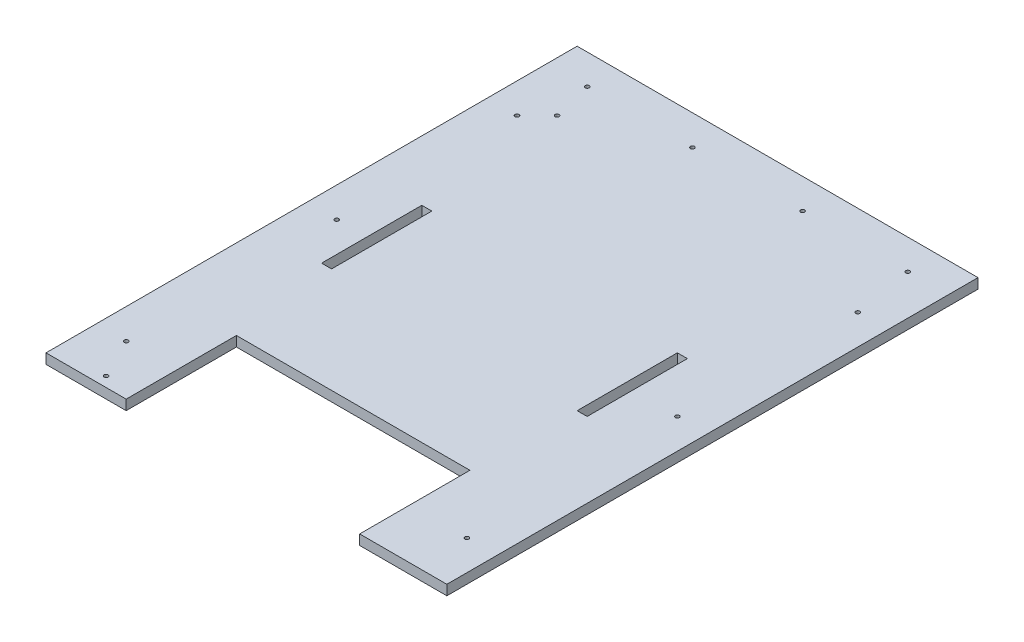
ISO-10303-21;
HEADER;
FILE_DESCRIPTION(('STEP AP214'),'2;1');
FILE_NAME('part.step','',(''),(''),'','','');
FILE_SCHEMA(('AUTOMOTIVE_DESIGN { 1 0 10303 214 1 1 1 1 }'));
ENDSEC;
DATA;
#1=APPLICATION_CONTEXT('core data for automotive mechanical design processes');
#2=APPLICATION_PROTOCOL_DEFINITION('international standard','automotive_design',2000,#1);
#3=PRODUCT_CONTEXT('',#1,'mechanical');
#4=PRODUCT('Part','Part','',(#3));
#5=PRODUCT_RELATED_PRODUCT_CATEGORY('part','',(#4));
#6=PRODUCT_DEFINITION_FORMATION('','',#4);
#7=PRODUCT_DEFINITION_CONTEXT('part definition',#1,'design');
#8=PRODUCT_DEFINITION('design','',#6,#7);
#9=PRODUCT_DEFINITION_SHAPE('','',#8);
#10=(LENGTH_UNIT() NAMED_UNIT(*) SI_UNIT(.MILLI.,.METRE.));
#11=(NAMED_UNIT(*) PLANE_ANGLE_UNIT() SI_UNIT($,.RADIAN.));
#12=(NAMED_UNIT(*) SI_UNIT($,.STERADIAN.) SOLID_ANGLE_UNIT());
#13=UNCERTAINTY_MEASURE_WITH_UNIT(LENGTH_MEASURE(1.E-05),#10,'distance_accuracy_value','');
#14=(GEOMETRIC_REPRESENTATION_CONTEXT(3) GLOBAL_UNCERTAINTY_ASSIGNED_CONTEXT((#13)) GLOBAL_UNIT_ASSIGNED_CONTEXT((#10,
#11,#12)) REPRESENTATION_CONTEXT('',''));
#15=CARTESIAN_POINT('',(0.,0.,0.));
#16=DIRECTION('',(0.,0.,1.));
#17=DIRECTION('',(1.,0.,0.));
#18=AXIS2_PLACEMENT_3D('',#15,#16,#17);
#19=CARTESIAN_POINT('',(0.,10.,0.));
#20=DIRECTION('',(0.,-1.,0.));
#21=DIRECTION('',(0.,0.,-1.));
#22=AXIS2_PLACEMENT_3D('',#19,#20,#21);
#23=PLANE('',#22);
#24=DIRECTION('',(0.,0.,1.));
#25=VECTOR('',#24,1.);
#26=CARTESIAN_POINT('',(-140.,10.,-215.));
#27=LINE('',#26,#25);
#28=CARTESIAN_POINT('',(-140.,10.,-315.));
#29=VERTEX_POINT('',#28);
#30=CARTESIAN_POINT('',(-140.,10.,-215.));
#31=VERTEX_POINT('',#30);
#32=EDGE_CURVE('E186',#29,#31,#27,.T.);
#33=ORIENTED_EDGE('',*,*,#32,.F.);
#34=DIRECTION('',(-1.,0.,0.));
#35=VECTOR('',#34,1.);
#36=CARTESIAN_POINT('',(-140.,10.,-315.));
#37=LINE('',#36,#35);
#38=CARTESIAN_POINT('',(-130.,10.,-315.));
#39=VERTEX_POINT('',#38);
#40=EDGE_CURVE('E194',#39,#29,#37,.T.);
#41=ORIENTED_EDGE('',*,*,#40,.F.);
#42=DIRECTION('',(0.,0.,-1.));
#43=VECTOR('',#42,1.);
#44=CARTESIAN_POINT('',(-130.,10.,-315.));
#45=LINE('',#44,#43);
#46=CARTESIAN_POINT('',(-130.,10.,-215.));
#47=VERTEX_POINT('',#46);
#48=EDGE_CURVE('E191',#47,#39,#45,.T.);
#49=ORIENTED_EDGE('',*,*,#48,.F.);
#50=DIRECTION('',(1.,0.,0.));
#51=VECTOR('',#50,1.);
#52=CARTESIAN_POINT('',(-130.,10.,-215.));
#53=LINE('',#52,#51);
#54=EDGE_CURVE('E188',#31,#47,#53,.T.);
#55=ORIENTED_EDGE('',*,*,#54,.F.);
#56=EDGE_LOOP('',(#33,#41,#49,#55));
#57=FACE_BOUND('',#56,.T.);
#58=DIRECTION('',(-1.,0.,0.));
#59=VECTOR('',#58,1.);
#60=CARTESIAN_POINT('',(-200.,10.,-530.));
#61=LINE('',#60,#59);
#62=CARTESIAN_POINT('',(200.,10.,-530.));
#63=VERTEX_POINT('',#62);
#64=CARTESIAN_POINT('',(-200.,10.,-530.));
#65=VERTEX_POINT('',#64);
#66=EDGE_CURVE('E229',#63,#65,#61,.T.);
#67=ORIENTED_EDGE('',*,*,#66,.T.);
#68=DIRECTION('',(0.,0.,1.));
#69=VECTOR('',#68,1.);
#70=CARTESIAN_POINT('',(-200.,10.,-530.));
#71=LINE('',#70,#69);
#72=CARTESIAN_POINT('',(-200.,10.,0.));
#73=VERTEX_POINT('',#72);
#74=EDGE_CURVE('E232',#65,#73,#71,.T.);
#75=ORIENTED_EDGE('',*,*,#74,.T.);
#76=DIRECTION('',(1.,0.,0.));
#77=VECTOR('',#76,1.);
#78=CARTESIAN_POINT('',(-200.,10.,0.));
#79=LINE('',#78,#77);
#80=CARTESIAN_POINT('',(-120.,10.,0.));
#81=VERTEX_POINT('',#80);
#82=EDGE_CURVE('E235',#73,#81,#79,.T.);
#83=ORIENTED_EDGE('',*,*,#82,.T.);
#84=DIRECTION('',(0.,0.,-1.));
#85=VECTOR('',#84,1.);
#86=CARTESIAN_POINT('',(-120.,10.,0.));
#87=LINE('',#86,#85);
#88=CARTESIAN_POINT('',(-120.,10.,-110.));
#89=VERTEX_POINT('',#88);
#90=EDGE_CURVE('E237',#81,#89,#87,.T.);
#91=ORIENTED_EDGE('',*,*,#90,.T.);
#92=DIRECTION('',(1.,0.,0.));
#93=VECTOR('',#92,1.);
#94=CARTESIAN_POINT('',(-120.,10.,-110.));
#95=LINE('',#94,#93);
#96=CARTESIAN_POINT('',(113.,10.,-110.));
#97=VERTEX_POINT('',#96);
#98=EDGE_CURVE('E239',#89,#97,#95,.T.);
#99=ORIENTED_EDGE('',*,*,#98,.T.);
#100=DIRECTION('',(0.,0.,1.));
#101=VECTOR('',#100,1.);
#102=CARTESIAN_POINT('',(113.,10.,-110.));
#103=LINE('',#102,#101);
#104=CARTESIAN_POINT('',(113.,10.,0.));
#105=VERTEX_POINT('',#104);
#106=EDGE_CURVE('E241',#97,#105,#103,.T.);
#107=ORIENTED_EDGE('',*,*,#106,.T.);
#108=DIRECTION('',(1.,0.,0.));
#109=VECTOR('',#108,1.);
#110=CARTESIAN_POINT('',(113.,10.,0.));
#111=LINE('',#110,#109);
#112=CARTESIAN_POINT('',(200.,10.,0.));
#113=VERTEX_POINT('',#112);
#114=EDGE_CURVE('E243',#105,#113,#111,.T.);
#115=ORIENTED_EDGE('',*,*,#114,.T.);
#116=DIRECTION('',(0.,0.,-1.));
#117=VECTOR('',#116,1.);
#118=CARTESIAN_POINT('',(200.,10.,-530.));
#119=LINE('',#118,#117);
#120=EDGE_CURVE('E245',#113,#63,#119,.T.);
#121=ORIENTED_EDGE('',*,*,#120,.T.);
#122=EDGE_LOOP('',(#67,#75,#83,#91,#99,#107,#115,#121));
#123=FACE_BOUND('',#122,.T.);
#124=CARTESIAN_POINT('',(-55.,10.,-500.));
#125=DIRECTION('',(0.,1.,0.));
#126=DIRECTION('',(0.,0.,1.));
#127=AXIS2_PLACEMENT_3D('',#124,#125,#126);
#128=CIRCLE('',#127,2.);
#129=CARTESIAN_POINT('',(-55.,10.,-498.));
#130=VERTEX_POINT('',#129);
#131=EDGE_CURVE('E223',#130,#130,#128,.T.);
#132=ORIENTED_EDGE('',*,*,#131,.F.);
#133=EDGE_LOOP('',(#132));
#134=FACE_BOUND('',#133,.T.);
#135=CARTESIAN_POINT('',(55.,10.,-500.));
#136=DIRECTION('',(0.,1.,0.));
#137=DIRECTION('',(0.,0.,1.));
#138=AXIS2_PLACEMENT_3D('',#135,#136,#137);
#139=CIRCLE('',#138,2.);
#140=CARTESIAN_POINT('',(55.,10.,-498.));
#141=VERTEX_POINT('',#140);
#142=EDGE_CURVE('E217',#141,#141,#139,.T.);
#143=ORIENTED_EDGE('',*,*,#142,.F.);
#144=EDGE_LOOP('',(#143));
#145=FACE_BOUND('',#144,.T.);
#146=DIRECTION('',(0.,0.,-1.));
#147=VECTOR('',#146,1.);
#148=CARTESIAN_POINT('',(125.,10.,-215.));
#149=LINE('',#148,#147);
#150=CARTESIAN_POINT('',(125.,10.,-215.));
#151=VERTEX_POINT('',#150);
#152=CARTESIAN_POINT('',(125.,10.,-315.));
#153=VERTEX_POINT('',#152);
#154=EDGE_CURVE('E147',#151,#153,#149,.T.);
#155=ORIENTED_EDGE('',*,*,#154,.F.);
#156=DIRECTION('',(1.,0.,0.));
#157=VECTOR('',#156,1.);
#158=CARTESIAN_POINT('',(115.,10.,-215.));
#159=LINE('',#158,#157);
#160=CARTESIAN_POINT('',(115.,10.,-215.));
#161=VERTEX_POINT('',#160);
#162=EDGE_CURVE('E170',#161,#151,#159,.T.);
#163=ORIENTED_EDGE('',*,*,#162,.F.);
#164=DIRECTION('',(0.,0.,1.));
#165=VECTOR('',#164,1.);
#166=CARTESIAN_POINT('',(115.,10.,-315.));
#167=LINE('',#166,#165);
#168=CARTESIAN_POINT('',(115.,10.,-315.));
#169=VERTEX_POINT('',#168);
#170=EDGE_CURVE('E168',#169,#161,#167,.T.);
#171=ORIENTED_EDGE('',*,*,#170,.F.);
#172=DIRECTION('',(-1.,0.,0.));
#173=VECTOR('',#172,1.);
#174=CARTESIAN_POINT('',(125.,10.,-315.));
#175=LINE('',#174,#173);
#176=EDGE_CURVE('E155',#153,#169,#175,.T.);
#177=ORIENTED_EDGE('',*,*,#176,.F.);
#178=EDGE_LOOP('',(#155,#163,#171,#177));
#179=FACE_BOUND('',#178,.T.);
#180=CARTESIAN_POINT('',(160.,10.,-500.));
#181=DIRECTION('',(0.,1.,0.));
#182=DIRECTION('',(0.,0.,1.));
#183=AXIS2_PLACEMENT_3D('',#180,#181,#182);
#184=CIRCLE('',#183,2.);
#185=CARTESIAN_POINT('',(160.,10.,-498.));
#186=VERTEX_POINT('',#185);
#187=EDGE_CURVE('E176',#186,#186,#184,.T.);
#188=ORIENTED_EDGE('',*,*,#187,.F.);
#189=EDGE_LOOP('',(#188));
#190=FACE_BOUND('',#189,.T.);
#191=CARTESIAN_POINT('',(-170.,10.,-260.));
#192=DIRECTION('',(0.,1.,0.));
#193=DIRECTION('',(0.,0.,1.));
#194=AXIS2_PLACEMENT_3D('',#191,#192,#193);
#195=CIRCLE('',#194,2.);
#196=CARTESIAN_POINT('',(-170.,10.,-258.));
#197=VERTEX_POINT('',#196);
#198=EDGE_CURVE('E427',#197,#197,#195,.T.);
#199=ORIENTED_EDGE('',*,*,#198,.F.);
#200=EDGE_LOOP('',(#199));
#201=FACE_BOUND('',#200,.T.);
#202=CARTESIAN_POINT('',(-170.,10.,-440.));
#203=DIRECTION('',(0.,1.,0.));
#204=DIRECTION('',(0.,0.,1.));
#205=AXIS2_PLACEMENT_3D('',#202,#203,#204);
#206=CIRCLE('',#205,2.);
#207=CARTESIAN_POINT('',(-170.,10.,-438.));
#208=VERTEX_POINT('',#207);
#209=EDGE_CURVE('E422',#208,#208,#206,.T.);
#210=ORIENTED_EDGE('',*,*,#209,.F.);
#211=EDGE_LOOP('',(#210));
#212=FACE_BOUND('',#211,.T.);
#213=CARTESIAN_POINT('',(-160.,10.,-500.));
#214=DIRECTION('',(0.,1.,0.));
#215=DIRECTION('',(0.,0.,1.));
#216=AXIS2_PLACEMENT_3D('',#213,#214,#215);
#217=CIRCLE('',#216,2.);
#218=CARTESIAN_POINT('',(-160.,10.,-498.));
#219=VERTEX_POINT('',#218);
#220=EDGE_CURVE('E417',#219,#219,#217,.T.);
#221=ORIENTED_EDGE('',*,*,#220,.F.);
#222=EDGE_LOOP('',(#221));
#223=FACE_BOUND('',#222,.T.);
#224=CARTESIAN_POINT('',(170.,10.,-260.));
#225=DIRECTION('',(0.,1.,0.));
#226=DIRECTION('',(0.,0.,1.));
#227=AXIS2_PLACEMENT_3D('',#224,#225,#226);
#228=CIRCLE('',#227,2.);
#229=CARTESIAN_POINT('',(170.,10.,-258.));
#230=VERTEX_POINT('',#229);
#231=EDGE_CURVE('E412',#230,#230,#228,.T.);
#232=ORIENTED_EDGE('',*,*,#231,.F.);
#233=EDGE_LOOP('',(#232));
#234=FACE_BOUND('',#233,.T.);
#235=CARTESIAN_POINT('',(170.,10.,-50.));
#236=DIRECTION('',(0.,1.,0.));
#237=DIRECTION('',(0.,0.,1.));
#238=AXIS2_PLACEMENT_3D('',#235,#236,#237);
#239=CIRCLE('',#238,2.);
#240=CARTESIAN_POINT('',(170.,10.,-48.));
#241=VERTEX_POINT('',#240);
#242=EDGE_CURVE('E407',#241,#241,#239,.T.);
#243=ORIENTED_EDGE('',*,*,#242,.F.);
#244=EDGE_LOOP('',(#243));
#245=FACE_BOUND('',#244,.T.);
#246=CARTESIAN_POINT('',(170.,10.,-440.));
#247=DIRECTION('',(0.,1.,0.));
#248=DIRECTION('',(0.,0.,1.));
#249=AXIS2_PLACEMENT_3D('',#246,#247,#248);
#250=CIRCLE('',#249,2.);
#251=CARTESIAN_POINT('',(170.,10.,-438.));
#252=VERTEX_POINT('',#251);
#253=EDGE_CURVE('E402',#252,#252,#250,.T.);
#254=ORIENTED_EDGE('',*,*,#253,.F.);
#255=EDGE_LOOP('',(#254));
#256=FACE_BOUND('',#255,.T.);
#257=CARTESIAN_POINT('',(-150.,10.,-460.));
#258=DIRECTION('',(0.,1.,0.));
#259=DIRECTION('',(0.,0.,1.));
#260=AXIS2_PLACEMENT_3D('',#257,#258,#259);
#261=CIRCLE('',#260,2.);
#262=CARTESIAN_POINT('',(-150.,10.,-458.));
#263=VERTEX_POINT('',#262);
#264=EDGE_CURVE('E397',#263,#263,#261,.T.);
#265=ORIENTED_EDGE('',*,*,#264,.F.);
#266=EDGE_LOOP('',(#265));
#267=FACE_BOUND('',#266,.T.);
#268=CARTESIAN_POINT('',(-170.,10.,-50.));
#269=DIRECTION('',(0.,1.,0.));
#270=DIRECTION('',(0.,0.,1.));
#271=AXIS2_PLACEMENT_3D('',#268,#269,#270);
#272=CIRCLE('',#271,2.);
#273=CARTESIAN_POINT('',(-170.,10.,-48.));
#274=VERTEX_POINT('',#273);
#275=EDGE_CURVE('E392',#274,#274,#272,.T.);
#276=ORIENTED_EDGE('',*,*,#275,.F.);
#277=EDGE_LOOP('',(#276));
#278=FACE_BOUND('',#277,.T.);
#279=CARTESIAN_POINT('',(-150.,10.,-10.));
#280=DIRECTION('',(0.,1.,0.));
#281=DIRECTION('',(0.,0.,1.));
#282=AXIS2_PLACEMENT_3D('',#279,#280,#281);
#283=CIRCLE('',#282,2.);
#284=CARTESIAN_POINT('',(-150.,10.,-8.));
#285=VERTEX_POINT('',#284);
#286=EDGE_CURVE('E386',#285,#285,#283,.T.);
#287=ORIENTED_EDGE('',*,*,#286,.F.);
#288=EDGE_LOOP('',(#287));
#289=FACE_BOUND('',#288,.T.);
#290=ADVANCED_FACE('F34',(#57,#123,#134,#145,#179,#190,#201,#212,#223,#234,#245,#256,#267,#278,
#289),#23,.F.);
#291=CARTESIAN_POINT('',(0.,0.,0.));
#292=DIRECTION('',(0.,-1.,0.));
#293=DIRECTION('',(0.,0.,-1.));
#294=AXIS2_PLACEMENT_3D('',#291,#292,#293);
#295=PLANE('',#294);
#296=CARTESIAN_POINT('',(-170.,0.,-50.));
#297=DIRECTION('',(0.,1.,0.));
#298=DIRECTION('',(0.,0.,1.));
#299=AXIS2_PLACEMENT_3D('',#296,#297,#298);
#300=CIRCLE('',#299,2.);
#301=CARTESIAN_POINT('',(-170.,0.,-48.));
#302=VERTEX_POINT('',#301);
#303=EDGE_CURVE('E389',#302,#302,#300,.T.);
#304=ORIENTED_EDGE('',*,*,#303,.T.);
#305=EDGE_LOOP('',(#304));
#306=FACE_BOUND('',#305,.T.);
#307=CARTESIAN_POINT('',(170.,0.,-440.));
#308=DIRECTION('',(0.,1.,0.));
#309=DIRECTION('',(0.,0.,1.));
#310=AXIS2_PLACEMENT_3D('',#307,#308,#309);
#311=CIRCLE('',#310,2.);
#312=CARTESIAN_POINT('',(170.,0.,-438.));
#313=VERTEX_POINT('',#312);
#314=EDGE_CURVE('E400',#313,#313,#311,.T.);
#315=ORIENTED_EDGE('',*,*,#314,.T.);
#316=EDGE_LOOP('',(#315));
#317=FACE_BOUND('',#316,.T.);
#318=CARTESIAN_POINT('',(170.,0.,-260.));
#319=DIRECTION('',(0.,1.,0.));
#320=DIRECTION('',(0.,0.,1.));
#321=AXIS2_PLACEMENT_3D('',#318,#319,#320);
#322=CIRCLE('',#321,2.);
#323=CARTESIAN_POINT('',(170.,0.,-258.));
#324=VERTEX_POINT('',#323);
#325=EDGE_CURVE('E410',#324,#324,#322,.T.);
#326=ORIENTED_EDGE('',*,*,#325,.T.);
#327=EDGE_LOOP('',(#326));
#328=FACE_BOUND('',#327,.T.);
#329=CARTESIAN_POINT('',(-170.,0.,-440.));
#330=DIRECTION('',(0.,1.,0.));
#331=DIRECTION('',(0.,0.,1.));
#332=AXIS2_PLACEMENT_3D('',#329,#330,#331);
#333=CIRCLE('',#332,2.);
#334=CARTESIAN_POINT('',(-170.,0.,-438.));
#335=VERTEX_POINT('',#334);
#336=EDGE_CURVE('E420',#335,#335,#333,.T.);
#337=ORIENTED_EDGE('',*,*,#336,.T.);
#338=EDGE_LOOP('',(#337));
#339=FACE_BOUND('',#338,.T.);
#340=CARTESIAN_POINT('',(160.,0.,-500.));
#341=DIRECTION('',(0.,1.,0.));
#342=DIRECTION('',(0.,0.,1.));
#343=AXIS2_PLACEMENT_3D('',#340,#341,#342);
#344=CIRCLE('',#343,2.);
#345=CARTESIAN_POINT('',(160.,0.,-498.));
#346=VERTEX_POINT('',#345);
#347=EDGE_CURVE('E430',#346,#346,#344,.T.);
#348=ORIENTED_EDGE('',*,*,#347,.T.);
#349=EDGE_LOOP('',(#348));
#350=FACE_BOUND('',#349,.T.);
#351=CARTESIAN_POINT('',(-55.,0.,-500.));
#352=DIRECTION('',(0.,1.,0.));
#353=DIRECTION('',(0.,0.,1.));
#354=AXIS2_PLACEMENT_3D('',#351,#352,#353);
#355=CIRCLE('',#354,2.);
#356=CARTESIAN_POINT('',(-55.,0.,-498.));
#357=VERTEX_POINT('',#356);
#358=EDGE_CURVE('E220',#357,#357,#355,.T.);
#359=ORIENTED_EDGE('',*,*,#358,.T.);
#360=EDGE_LOOP('',(#359));
#361=FACE_BOUND('',#360,.T.);
#362=DIRECTION('',(-1.,0.,0.));
#363=VECTOR('',#362,1.);
#364=CARTESIAN_POINT('',(-200.,0.,-530.));
#365=LINE('',#364,#363);
#366=CARTESIAN_POINT('',(200.,0.,-530.));
#367=VERTEX_POINT('',#366);
#368=CARTESIAN_POINT('',(-200.,0.,-530.));
#369=VERTEX_POINT('',#368);
#370=EDGE_CURVE('E226',#367,#369,#365,.T.);
#371=ORIENTED_EDGE('',*,*,#370,.F.);
#372=DIRECTION('',(0.,0.,-1.));
#373=VECTOR('',#372,1.);
#374=CARTESIAN_POINT('',(200.,0.,-530.));
#375=LINE('',#374,#373);
#376=CARTESIAN_POINT('',(200.,0.,0.));
#377=VERTEX_POINT('',#376);
#378=EDGE_CURVE('E233',#377,#367,#375,.T.);
#379=ORIENTED_EDGE('',*,*,#378,.F.);
#380=DIRECTION('',(1.,0.,0.));
#381=VECTOR('',#380,1.);
#382=CARTESIAN_POINT('',(113.,0.,0.));
#383=LINE('',#382,#381);
#384=CARTESIAN_POINT('',(113.,0.,0.));
#385=VERTEX_POINT('',#384);
#386=EDGE_CURVE('E260',#385,#377,#383,.T.);
#387=ORIENTED_EDGE('',*,*,#386,.F.);
#388=DIRECTION('',(0.,0.,1.));
#389=VECTOR('',#388,1.);
#390=CARTESIAN_POINT('',(113.,0.,-110.));
#391=LINE('',#390,#389);
#392=CARTESIAN_POINT('',(113.,0.,-110.));
#393=VERTEX_POINT('',#392);
#394=EDGE_CURVE('E258',#393,#385,#391,.T.);
#395=ORIENTED_EDGE('',*,*,#394,.F.);
#396=DIRECTION('',(1.,0.,0.));
#397=VECTOR('',#396,1.);
#398=CARTESIAN_POINT('',(-120.,0.,-110.));
#399=LINE('',#398,#397);
#400=CARTESIAN_POINT('',(-120.,0.,-110.));
#401=VERTEX_POINT('',#400);
#402=EDGE_CURVE('E256',#401,#393,#399,.T.);
#403=ORIENTED_EDGE('',*,*,#402,.F.);
#404=DIRECTION('',(0.,0.,-1.));
#405=VECTOR('',#404,1.);
#406=CARTESIAN_POINT('',(-120.,0.,0.));
#407=LINE('',#406,#405);
#408=CARTESIAN_POINT('',(-120.,0.,0.));
#409=VERTEX_POINT('',#408);
#410=EDGE_CURVE('E254',#409,#401,#407,.T.);
#411=ORIENTED_EDGE('',*,*,#410,.F.);
#412=DIRECTION('',(1.,0.,0.));
#413=VECTOR('',#412,1.);
#414=CARTESIAN_POINT('',(-200.,0.,0.));
#415=LINE('',#414,#413);
#416=CARTESIAN_POINT('',(-200.,0.,0.));
#417=VERTEX_POINT('',#416);
#418=EDGE_CURVE('E252',#417,#409,#415,.T.);
#419=ORIENTED_EDGE('',*,*,#418,.F.);
#420=DIRECTION('',(0.,0.,1.));
#421=VECTOR('',#420,1.);
#422=CARTESIAN_POINT('',(-200.,0.,-530.));
#423=LINE('',#422,#421);
#424=EDGE_CURVE('E250',#369,#417,#423,.T.);
#425=ORIENTED_EDGE('',*,*,#424,.F.);
#426=EDGE_LOOP('',(#371,#379,#387,#395,#403,#411,#419,#425));
#427=FACE_BOUND('',#426,.T.);
#428=CARTESIAN_POINT('',(55.,0.,-500.));
#429=DIRECTION('',(0.,1.,0.));
#430=DIRECTION('',(0.,0.,1.));
#431=AXIS2_PLACEMENT_3D('',#428,#429,#430);
#432=CIRCLE('',#431,2.);
#433=CARTESIAN_POINT('',(55.,0.,-498.));
#434=VERTEX_POINT('',#433);
#435=EDGE_CURVE('E216',#434,#434,#432,.T.);
#436=ORIENTED_EDGE('',*,*,#435,.T.);
#437=EDGE_LOOP('',(#436));
#438=FACE_BOUND('',#437,.T.);
#439=DIRECTION('',(-1.,0.,0.));
#440=VECTOR('',#439,1.);
#441=CARTESIAN_POINT('',(-140.,0.,-315.));
#442=LINE('',#441,#440);
#443=CARTESIAN_POINT('',(-130.,0.,-315.));
#444=VERTEX_POINT('',#443);
#445=CARTESIAN_POINT('',(-140.,0.,-315.));
#446=VERTEX_POINT('',#445);
#447=EDGE_CURVE('E189',#444,#446,#442,.T.);
#448=ORIENTED_EDGE('',*,*,#447,.T.);
#449=DIRECTION('',(0.,0.,1.));
#450=VECTOR('',#449,1.);
#451=CARTESIAN_POINT('',(-140.,0.,-215.));
#452=LINE('',#451,#450);
#453=CARTESIAN_POINT('',(-140.,0.,-215.));
#454=VERTEX_POINT('',#453);
#455=EDGE_CURVE('E163',#446,#454,#452,.T.);
#456=ORIENTED_EDGE('',*,*,#455,.T.);
#457=DIRECTION('',(1.,0.,0.));
#458=VECTOR('',#457,1.);
#459=CARTESIAN_POINT('',(-130.,0.,-215.));
#460=LINE('',#459,#458);
#461=CARTESIAN_POINT('',(-130.,0.,-215.));
#462=VERTEX_POINT('',#461);
#463=EDGE_CURVE('E199',#454,#462,#460,.T.);
#464=ORIENTED_EDGE('',*,*,#463,.T.);
#465=DIRECTION('',(0.,0.,-1.));
#466=VECTOR('',#465,1.);
#467=CARTESIAN_POINT('',(-130.,0.,-315.));
#468=LINE('',#467,#466);
#469=EDGE_CURVE('E202',#462,#444,#468,.T.);
#470=ORIENTED_EDGE('',*,*,#469,.T.);
#471=EDGE_LOOP('',(#448,#456,#464,#470));
#472=FACE_BOUND('',#471,.T.);
#473=DIRECTION('',(1.,0.,0.));
#474=VECTOR('',#473,1.);
#475=CARTESIAN_POINT('',(115.,0.,-215.));
#476=LINE('',#475,#474);
#477=CARTESIAN_POINT('',(115.,0.,-215.));
#478=VERTEX_POINT('',#477);
#479=CARTESIAN_POINT('',(125.,0.,-215.));
#480=VERTEX_POINT('',#479);
#481=EDGE_CURVE('E156',#478,#480,#476,.T.);
#482=ORIENTED_EDGE('',*,*,#481,.T.);
#483=DIRECTION('',(0.,0.,-1.));
#484=VECTOR('',#483,1.);
#485=CARTESIAN_POINT('',(125.,0.,-215.));
#486=LINE('',#485,#484);
#487=CARTESIAN_POINT('',(125.,0.,-315.));
#488=VERTEX_POINT('',#487);
#489=EDGE_CURVE('E57',#480,#488,#486,.T.);
#490=ORIENTED_EDGE('',*,*,#489,.T.);
#491=DIRECTION('',(-1.,0.,0.));
#492=VECTOR('',#491,1.);
#493=CARTESIAN_POINT('',(125.,0.,-315.));
#494=LINE('',#493,#492);
#495=CARTESIAN_POINT('',(115.,0.,-315.));
#496=VERTEX_POINT('',#495);
#497=EDGE_CURVE('E162',#488,#496,#494,.T.);
#498=ORIENTED_EDGE('',*,*,#497,.T.);
#499=DIRECTION('',(0.,0.,1.));
#500=VECTOR('',#499,1.);
#501=CARTESIAN_POINT('',(115.,0.,-315.));
#502=LINE('',#501,#500);
#503=EDGE_CURVE('E178',#496,#478,#502,.T.);
#504=ORIENTED_EDGE('',*,*,#503,.T.);
#505=EDGE_LOOP('',(#482,#490,#498,#504));
#506=FACE_BOUND('',#505,.T.);
#507=CARTESIAN_POINT('',(-170.,0.,-260.));
#508=DIRECTION('',(0.,1.,0.));
#509=DIRECTION('',(0.,0.,1.));
#510=AXIS2_PLACEMENT_3D('',#507,#508,#509);
#511=CIRCLE('',#510,2.);
#512=CARTESIAN_POINT('',(-170.,0.,-258.));
#513=VERTEX_POINT('',#512);
#514=EDGE_CURVE('E369',#513,#513,#511,.T.);
#515=ORIENTED_EDGE('',*,*,#514,.T.);
#516=EDGE_LOOP('',(#515));
#517=FACE_BOUND('',#516,.T.);
#518=CARTESIAN_POINT('',(-160.,0.,-500.));
#519=DIRECTION('',(0.,1.,0.));
#520=DIRECTION('',(0.,0.,1.));
#521=AXIS2_PLACEMENT_3D('',#518,#519,#520);
#522=CIRCLE('',#521,2.);
#523=CARTESIAN_POINT('',(-160.,0.,-498.));
#524=VERTEX_POINT('',#523);
#525=EDGE_CURVE('E373',#524,#524,#522,.T.);
#526=ORIENTED_EDGE('',*,*,#525,.T.);
#527=EDGE_LOOP('',(#526));
#528=FACE_BOUND('',#527,.T.);
#529=CARTESIAN_POINT('',(170.,0.,-50.));
#530=DIRECTION('',(0.,1.,0.));
#531=DIRECTION('',(0.,0.,1.));
#532=AXIS2_PLACEMENT_3D('',#529,#530,#531);
#533=CIRCLE('',#532,2.);
#534=CARTESIAN_POINT('',(170.,0.,-48.));
#535=VERTEX_POINT('',#534);
#536=EDGE_CURVE('E377',#535,#535,#533,.T.);
#537=ORIENTED_EDGE('',*,*,#536,.T.);
#538=EDGE_LOOP('',(#537));
#539=FACE_BOUND('',#538,.T.);
#540=CARTESIAN_POINT('',(-150.,0.,-460.));
#541=DIRECTION('',(0.,1.,0.));
#542=DIRECTION('',(0.,0.,1.));
#543=AXIS2_PLACEMENT_3D('',#540,#541,#542);
#544=CIRCLE('',#543,2.);
#545=CARTESIAN_POINT('',(-150.,0.,-458.));
#546=VERTEX_POINT('',#545);
#547=EDGE_CURVE('E381',#546,#546,#544,.T.);
#548=ORIENTED_EDGE('',*,*,#547,.T.);
#549=EDGE_LOOP('',(#548));
#550=FACE_BOUND('',#549,.T.);
#551=CARTESIAN_POINT('',(-150.,0.,-10.));
#552=DIRECTION('',(0.,1.,0.));
#553=DIRECTION('',(0.,0.,1.));
#554=AXIS2_PLACEMENT_3D('',#551,#552,#553);
#555=CIRCLE('',#554,2.);
#556=CARTESIAN_POINT('',(-150.,0.,-8.));
#557=VERTEX_POINT('',#556);
#558=EDGE_CURVE('E384',#557,#557,#555,.T.);
#559=ORIENTED_EDGE('',*,*,#558,.T.);
#560=EDGE_LOOP('',(#559));
#561=FACE_BOUND('',#560,.T.);
#562=ADVANCED_FACE('F290',(#306,#317,#328,#339,#350,#361,#427,#438,#472,#506,#517,#528,#539,
#550,#561),#295,.T.);
#563=CARTESIAN_POINT('',(-200.,10.,-530.));
#564=DIRECTION('',(0.,0.,1.));
#565=DIRECTION('',(1.,0.,0.));
#566=AXIS2_PLACEMENT_3D('',#563,#564,#565);
#567=PLANE('',#566);
#568=ORIENTED_EDGE('',*,*,#370,.T.);
#569=DIRECTION('',(0.,-1.,0.));
#570=VECTOR('',#569,1.);
#571=CARTESIAN_POINT('',(-200.,10.,-530.));
#572=LINE('',#571,#570);
#573=EDGE_CURVE('E11',#65,#369,#572,.T.);
#574=ORIENTED_EDGE('',*,*,#573,.F.);
#575=ORIENTED_EDGE('',*,*,#66,.F.);
#576=DIRECTION('',(0.,-1.,0.));
#577=VECTOR('',#576,1.);
#578=CARTESIAN_POINT('',(200.,10.,-530.));
#579=LINE('',#578,#577);
#580=EDGE_CURVE('E247',#63,#367,#579,.T.);
#581=ORIENTED_EDGE('',*,*,#580,.T.);
#582=EDGE_LOOP('',(#568,#574,#575,#581));
#583=FACE_BOUND('',#582,.T.);
#584=ADVANCED_FACE('F36',(#583),#567,.F.);
#585=CARTESIAN_POINT('',(-200.,10.,-530.));
#586=DIRECTION('',(1.,0.,0.));
#587=DIRECTION('',(0.,0.,-1.));
#588=AXIS2_PLACEMENT_3D('',#585,#586,#587);
#589=PLANE('',#588);
#590=ORIENTED_EDGE('',*,*,#424,.T.);
#591=DIRECTION('',(0.,-1.,0.));
#592=VECTOR('',#591,1.);
#593=CARTESIAN_POINT('',(-200.,10.,0.));
#594=LINE('',#593,#592);
#595=EDGE_CURVE('E42',#73,#417,#594,.T.);
#596=ORIENTED_EDGE('',*,*,#595,.F.);
#597=ORIENTED_EDGE('',*,*,#74,.F.);
#598=ORIENTED_EDGE('',*,*,#573,.T.);
#599=EDGE_LOOP('',(#590,#596,#597,#598));
#600=FACE_BOUND('',#599,.T.);
#601=ADVANCED_FACE('F308',(#600),#589,.F.);
#602=CARTESIAN_POINT('',(-200.,10.,0.));
#603=DIRECTION('',(0.,0.,-1.));
#604=DIRECTION('',(-1.,0.,0.));
#605=AXIS2_PLACEMENT_3D('',#602,#603,#604);
#606=PLANE('',#605);
#607=ORIENTED_EDGE('',*,*,#418,.T.);
#608=DIRECTION('',(0.,-1.,0.));
#609=VECTOR('',#608,1.);
#610=CARTESIAN_POINT('',(-120.,10.,0.));
#611=LINE('',#610,#609);
#612=EDGE_CURVE('E277',#81,#409,#611,.T.);
#613=ORIENTED_EDGE('',*,*,#612,.F.);
#614=ORIENTED_EDGE('',*,*,#82,.F.);
#615=ORIENTED_EDGE('',*,*,#595,.T.);
#616=EDGE_LOOP('',(#607,#613,#614,#615));
#617=FACE_BOUND('',#616,.T.);
#618=ADVANCED_FACE('F284',(#617),#606,.F.);
#619=CARTESIAN_POINT('',(-120.,10.,0.));
#620=DIRECTION('',(-1.,0.,0.));
#621=DIRECTION('',(0.,0.,1.));
#622=AXIS2_PLACEMENT_3D('',#619,#620,#621);
#623=PLANE('',#622);
#624=ORIENTED_EDGE('',*,*,#410,.T.);
#625=DIRECTION('',(0.,-1.,0.));
#626=VECTOR('',#625,1.);
#627=CARTESIAN_POINT('',(-120.,10.,-110.));
#628=LINE('',#627,#626);
#629=EDGE_CURVE('E274',#89,#401,#628,.T.);
#630=ORIENTED_EDGE('',*,*,#629,.F.);
#631=ORIENTED_EDGE('',*,*,#90,.F.);
#632=ORIENTED_EDGE('',*,*,#612,.T.);
#633=EDGE_LOOP('',(#624,#630,#631,#632));
#634=FACE_BOUND('',#633,.T.);
#635=ADVANCED_FACE('F296',(#634),#623,.F.);
#636=CARTESIAN_POINT('',(-120.,10.,-110.));
#637=DIRECTION('',(0.,0.,-1.));
#638=DIRECTION('',(-1.,0.,0.));
#639=AXIS2_PLACEMENT_3D('',#636,#637,#638);
#640=PLANE('',#639);
#641=ORIENTED_EDGE('',*,*,#402,.T.);
#642=DIRECTION('',(0.,-1.,0.));
#643=VECTOR('',#642,1.);
#644=CARTESIAN_POINT('',(113.,10.,-110.));
#645=LINE('',#644,#643);
#646=EDGE_CURVE('E271',#97,#393,#645,.T.);
#647=ORIENTED_EDGE('',*,*,#646,.F.);
#648=ORIENTED_EDGE('',*,*,#98,.F.);
#649=ORIENTED_EDGE('',*,*,#629,.T.);
#650=EDGE_LOOP('',(#641,#647,#648,#649));
#651=FACE_BOUND('',#650,.T.);
#652=ADVANCED_FACE('F300',(#651),#640,.F.);
#653=CARTESIAN_POINT('',(113.,10.,-110.));
#654=DIRECTION('',(1.,0.,0.));
#655=DIRECTION('',(0.,0.,-1.));
#656=AXIS2_PLACEMENT_3D('',#653,#654,#655);
#657=PLANE('',#656);
#658=ORIENTED_EDGE('',*,*,#394,.T.);
#659=DIRECTION('',(0.,-1.,0.));
#660=VECTOR('',#659,1.);
#661=CARTESIAN_POINT('',(113.,10.,0.));
#662=LINE('',#661,#660);
#663=EDGE_CURVE('E268',#105,#385,#662,.T.);
#664=ORIENTED_EDGE('',*,*,#663,.F.);
#665=ORIENTED_EDGE('',*,*,#106,.F.);
#666=ORIENTED_EDGE('',*,*,#646,.T.);
#667=EDGE_LOOP('',(#658,#664,#665,#666));
#668=FACE_BOUND('',#667,.T.);
#669=ADVANCED_FACE('F321',(#668),#657,.F.);
#670=CARTESIAN_POINT('',(113.,10.,0.));
#671=DIRECTION('',(0.,0.,-1.));
#672=DIRECTION('',(-1.,0.,0.));
#673=AXIS2_PLACEMENT_3D('',#670,#671,#672);
#674=PLANE('',#673);
#675=ORIENTED_EDGE('',*,*,#386,.T.);
#676=DIRECTION('',(0.,-1.,0.));
#677=VECTOR('',#676,1.);
#678=CARTESIAN_POINT('',(200.,10.,0.));
#679=LINE('',#678,#677);
#680=EDGE_CURVE('E265',#113,#377,#679,.T.);
#681=ORIENTED_EDGE('',*,*,#680,.F.);
#682=ORIENTED_EDGE('',*,*,#114,.F.);
#683=ORIENTED_EDGE('',*,*,#663,.T.);
#684=EDGE_LOOP('',(#675,#681,#682,#683));
#685=FACE_BOUND('',#684,.T.);
#686=ADVANCED_FACE('F319',(#685),#674,.F.);
#687=CARTESIAN_POINT('',(200.,10.,-530.));
#688=DIRECTION('',(-1.,0.,0.));
#689=DIRECTION('',(0.,0.,1.));
#690=AXIS2_PLACEMENT_3D('',#687,#688,#689);
#691=PLANE('',#690);
#692=ORIENTED_EDGE('',*,*,#378,.T.);
#693=ORIENTED_EDGE('',*,*,#580,.F.);
#694=ORIENTED_EDGE('',*,*,#120,.F.);
#695=ORIENTED_EDGE('',*,*,#680,.T.);
#696=EDGE_LOOP('',(#692,#693,#694,#695));
#697=FACE_BOUND('',#696,.T.);
#698=ADVANCED_FACE('F314',(#697),#691,.F.);
#699=CARTESIAN_POINT('',(-55.,10.,-500.));
#700=DIRECTION('',(0.,-1.,0.));
#701=DIRECTION('',(0.,0.,-1.));
#702=AXIS2_PLACEMENT_3D('',#699,#700,#701);
#703=CYLINDRICAL_SURFACE('',#702,2.);
#704=ORIENTED_EDGE('',*,*,#131,.T.);
#705=EDGE_LOOP('',(#704));
#706=FACE_BOUND('',#705,.T.);
#707=ORIENTED_EDGE('',*,*,#358,.F.);
#708=EDGE_LOOP('',(#707));
#709=FACE_BOUND('',#708,.T.);
#710=ADVANCED_FACE('F340',(#706,#709),#703,.F.);
#711=CARTESIAN_POINT('',(55.,10.,-500.));
#712=DIRECTION('',(0.,-1.,0.));
#713=DIRECTION('',(0.,0.,-1.));
#714=AXIS2_PLACEMENT_3D('',#711,#712,#713);
#715=CYLINDRICAL_SURFACE('',#714,2.);
#716=ORIENTED_EDGE('',*,*,#142,.T.);
#717=EDGE_LOOP('',(#716));
#718=FACE_BOUND('',#717,.T.);
#719=ORIENTED_EDGE('',*,*,#435,.F.);
#720=EDGE_LOOP('',(#719));
#721=FACE_BOUND('',#720,.T.);
#722=ADVANCED_FACE('F347',(#718,#721),#715,.F.);
#723=CARTESIAN_POINT('',(-140.,10.,-215.));
#724=DIRECTION('',(1.,0.,0.));
#725=DIRECTION('',(0.,0.,-1.));
#726=AXIS2_PLACEMENT_3D('',#723,#724,#725);
#727=PLANE('',#726);
#728=ORIENTED_EDGE('',*,*,#455,.F.);
#729=DIRECTION('',(0.,-1.,0.));
#730=VECTOR('',#729,1.);
#731=CARTESIAN_POINT('',(-140.,10.,-315.));
#732=LINE('',#731,#730);
#733=EDGE_CURVE('E196',#29,#446,#732,.T.);
#734=ORIENTED_EDGE('',*,*,#733,.F.);
#735=ORIENTED_EDGE('',*,*,#32,.T.);
#736=DIRECTION('',(0.,-1.,0.));
#737=VECTOR('',#736,1.);
#738=CARTESIAN_POINT('',(-140.,10.,-215.));
#739=LINE('',#738,#737);
#740=EDGE_CURVE('E213',#31,#454,#739,.T.);
#741=ORIENTED_EDGE('',*,*,#740,.T.);
#742=EDGE_LOOP('',(#728,#734,#735,#741));
#743=FACE_BOUND('',#742,.T.);
#744=ADVANCED_FACE('F352',(#743),#727,.T.);
#745=CARTESIAN_POINT('',(-130.,10.,-215.));
#746=DIRECTION('',(0.,0.,-1.));
#747=DIRECTION('',(-1.,0.,0.));
#748=AXIS2_PLACEMENT_3D('',#745,#746,#747);
#749=PLANE('',#748);
#750=ORIENTED_EDGE('',*,*,#463,.F.);
#751=ORIENTED_EDGE('',*,*,#740,.F.);
#752=ORIENTED_EDGE('',*,*,#54,.T.);
#753=DIRECTION('',(0.,-1.,0.));
#754=VECTOR('',#753,1.);
#755=CARTESIAN_POINT('',(-130.,10.,-215.));
#756=LINE('',#755,#754);
#757=EDGE_CURVE('E211',#47,#462,#756,.T.);
#758=ORIENTED_EDGE('',*,*,#757,.T.);
#759=EDGE_LOOP('',(#750,#751,#752,#758));
#760=FACE_BOUND('',#759,.T.);
#761=ADVANCED_FACE('F468',(#760),#749,.T.);
#762=CARTESIAN_POINT('',(-130.,10.,-315.));
#763=DIRECTION('',(-1.,0.,0.));
#764=DIRECTION('',(0.,0.,1.));
#765=AXIS2_PLACEMENT_3D('',#762,#763,#764);
#766=PLANE('',#765);
#767=ORIENTED_EDGE('',*,*,#469,.F.);
#768=ORIENTED_EDGE('',*,*,#757,.F.);
#769=ORIENTED_EDGE('',*,*,#48,.T.);
#770=DIRECTION('',(0.,-1.,0.));
#771=VECTOR('',#770,1.);
#772=CARTESIAN_POINT('',(-130.,10.,-315.));
#773=LINE('',#772,#771);
#774=EDGE_CURVE('E209',#39,#444,#773,.T.);
#775=ORIENTED_EDGE('',*,*,#774,.T.);
#776=EDGE_LOOP('',(#767,#768,#769,#775));
#777=FACE_BOUND('',#776,.T.);
#778=ADVANCED_FACE('F464',(#777),#766,.T.);
#779=CARTESIAN_POINT('',(-140.,10.,-315.));
#780=DIRECTION('',(0.,0.,1.));
#781=DIRECTION('',(1.,0.,0.));
#782=AXIS2_PLACEMENT_3D('',#779,#780,#781);
#783=PLANE('',#782);
#784=ORIENTED_EDGE('',*,*,#447,.F.);
#785=ORIENTED_EDGE('',*,*,#774,.F.);
#786=ORIENTED_EDGE('',*,*,#40,.T.);
#787=ORIENTED_EDGE('',*,*,#733,.T.);
#788=EDGE_LOOP('',(#784,#785,#786,#787));
#789=FACE_BOUND('',#788,.T.);
#790=ADVANCED_FACE('F461',(#789),#783,.T.);
#791=CARTESIAN_POINT('',(125.,10.,-215.));
#792=DIRECTION('',(-1.,0.,0.));
#793=DIRECTION('',(0.,0.,1.));
#794=AXIS2_PLACEMENT_3D('',#791,#792,#793);
#795=PLANE('',#794);
#796=ORIENTED_EDGE('',*,*,#489,.F.);
#797=DIRECTION('',(0.,-1.,0.));
#798=VECTOR('',#797,1.);
#799=CARTESIAN_POINT('',(125.,10.,-215.));
#800=LINE('',#799,#798);
#801=EDGE_CURVE('E151',#151,#480,#800,.T.);
#802=ORIENTED_EDGE('',*,*,#801,.F.);
#803=ORIENTED_EDGE('',*,*,#154,.T.);
#804=DIRECTION('',(0.,-1.,0.));
#805=VECTOR('',#804,1.);
#806=CARTESIAN_POINT('',(125.,10.,-315.));
#807=LINE('',#806,#805);
#808=EDGE_CURVE('E150',#153,#488,#807,.T.);
#809=ORIENTED_EDGE('',*,*,#808,.T.);
#810=EDGE_LOOP('',(#796,#802,#803,#809));
#811=FACE_BOUND('',#810,.T.);
#812=ADVANCED_FACE('F149',(#811),#795,.T.);
#813=CARTESIAN_POINT('',(125.,10.,-315.));
#814=DIRECTION('',(0.,0.,1.));
#815=DIRECTION('',(1.,0.,0.));
#816=AXIS2_PLACEMENT_3D('',#813,#814,#815);
#817=PLANE('',#816);
#818=ORIENTED_EDGE('',*,*,#497,.F.);
#819=ORIENTED_EDGE('',*,*,#808,.F.);
#820=ORIENTED_EDGE('',*,*,#176,.T.);
#821=DIRECTION('',(0.,-1.,0.));
#822=VECTOR('',#821,1.);
#823=CARTESIAN_POINT('',(115.,10.,-315.));
#824=LINE('',#823,#822);
#825=EDGE_CURVE('E164',#169,#496,#824,.T.);
#826=ORIENTED_EDGE('',*,*,#825,.T.);
#827=EDGE_LOOP('',(#818,#819,#820,#826));
#828=FACE_BOUND('',#827,.T.);
#829=ADVANCED_FACE('F159',(#828),#817,.T.);
#830=CARTESIAN_POINT('',(115.,10.,-315.));
#831=DIRECTION('',(1.,0.,0.));
#832=DIRECTION('',(0.,0.,-1.));
#833=AXIS2_PLACEMENT_3D('',#830,#831,#832);
#834=PLANE('',#833);
#835=ORIENTED_EDGE('',*,*,#503,.F.);
#836=ORIENTED_EDGE('',*,*,#825,.F.);
#837=ORIENTED_EDGE('',*,*,#170,.T.);
#838=DIRECTION('',(0.,-1.,0.));
#839=VECTOR('',#838,1.);
#840=CARTESIAN_POINT('',(115.,10.,-215.));
#841=LINE('',#840,#839);
#842=EDGE_CURVE('E49',#161,#478,#841,.T.);
#843=ORIENTED_EDGE('',*,*,#842,.T.);
#844=EDGE_LOOP('',(#835,#836,#837,#843));
#845=FACE_BOUND('',#844,.T.);
#846=ADVANCED_FACE('F450',(#845),#834,.T.);
#847=CARTESIAN_POINT('',(115.,10.,-215.));
#848=DIRECTION('',(0.,0.,-1.));
#849=DIRECTION('',(-1.,0.,0.));
#850=AXIS2_PLACEMENT_3D('',#847,#848,#849);
#851=PLANE('',#850);
#852=ORIENTED_EDGE('',*,*,#481,.F.);
#853=ORIENTED_EDGE('',*,*,#842,.F.);
#854=ORIENTED_EDGE('',*,*,#162,.T.);
#855=ORIENTED_EDGE('',*,*,#801,.T.);
#856=EDGE_LOOP('',(#852,#853,#854,#855));
#857=FACE_BOUND('',#856,.T.);
#858=ADVANCED_FACE('F440',(#857),#851,.T.);
#859=CARTESIAN_POINT('',(160.,10.,-500.));
#860=DIRECTION('',(0.,-1.,0.));
#861=DIRECTION('',(0.,0.,-1.));
#862=AXIS2_PLACEMENT_3D('',#859,#860,#861);
#863=CYLINDRICAL_SURFACE('',#862,2.);
#864=ORIENTED_EDGE('',*,*,#187,.T.);
#865=EDGE_LOOP('',(#864));
#866=FACE_BOUND('',#865,.T.);
#867=ORIENTED_EDGE('',*,*,#347,.F.);
#868=EDGE_LOOP('',(#867));
#869=FACE_BOUND('',#868,.T.);
#870=ADVANCED_FACE('F437',(#866,#869),#863,.F.);
#871=CARTESIAN_POINT('',(-170.,10.,-260.));
#872=DIRECTION('',(0.,-1.,0.));
#873=DIRECTION('',(0.,0.,-1.));
#874=AXIS2_PLACEMENT_3D('',#871,#872,#873);
#875=CYLINDRICAL_SURFACE('',#874,2.);
#876=ORIENTED_EDGE('',*,*,#198,.T.);
#877=EDGE_LOOP('',(#876));
#878=FACE_BOUND('',#877,.T.);
#879=ORIENTED_EDGE('',*,*,#514,.F.);
#880=EDGE_LOOP('',(#879));
#881=FACE_BOUND('',#880,.T.);
#882=ADVANCED_FACE('F439',(#878,#881),#875,.F.);
#883=CARTESIAN_POINT('',(-170.,10.,-440.));
#884=DIRECTION('',(0.,-1.,0.));
#885=DIRECTION('',(0.,0.,-1.));
#886=AXIS2_PLACEMENT_3D('',#883,#884,#885);
#887=CYLINDRICAL_SURFACE('',#886,2.);
#888=ORIENTED_EDGE('',*,*,#209,.T.);
#889=EDGE_LOOP('',(#888));
#890=FACE_BOUND('',#889,.T.);
#891=ORIENTED_EDGE('',*,*,#336,.F.);
#892=EDGE_LOOP('',(#891));
#893=FACE_BOUND('',#892,.T.);
#894=ADVANCED_FACE('F447',(#890,#893),#887,.F.);
#895=CARTESIAN_POINT('',(-160.,10.,-500.));
#896=DIRECTION('',(0.,-1.,0.));
#897=DIRECTION('',(0.,0.,-1.));
#898=AXIS2_PLACEMENT_3D('',#895,#896,#897);
#899=CYLINDRICAL_SURFACE('',#898,2.);
#900=ORIENTED_EDGE('',*,*,#220,.T.);
#901=EDGE_LOOP('',(#900));
#902=FACE_BOUND('',#901,.T.);
#903=ORIENTED_EDGE('',*,*,#525,.F.);
#904=EDGE_LOOP('',(#903));
#905=FACE_BOUND('',#904,.T.);
#906=ADVANCED_FACE('F533',(#902,#905),#899,.F.);
#907=CARTESIAN_POINT('',(170.,10.,-260.));
#908=DIRECTION('',(0.,-1.,0.));
#909=DIRECTION('',(0.,0.,-1.));
#910=AXIS2_PLACEMENT_3D('',#907,#908,#909);
#911=CYLINDRICAL_SURFACE('',#910,2.);
#912=ORIENTED_EDGE('',*,*,#231,.T.);
#913=EDGE_LOOP('',(#912));
#914=FACE_BOUND('',#913,.T.);
#915=ORIENTED_EDGE('',*,*,#325,.F.);
#916=EDGE_LOOP('',(#915));
#917=FACE_BOUND('',#916,.T.);
#918=ADVANCED_FACE('F542',(#914,#917),#911,.F.);
#919=CARTESIAN_POINT('',(170.,10.,-50.));
#920=DIRECTION('',(0.,-1.,0.));
#921=DIRECTION('',(0.,0.,-1.));
#922=AXIS2_PLACEMENT_3D('',#919,#920,#921);
#923=CYLINDRICAL_SURFACE('',#922,2.);
#924=ORIENTED_EDGE('',*,*,#242,.T.);
#925=EDGE_LOOP('',(#924));
#926=FACE_BOUND('',#925,.T.);
#927=ORIENTED_EDGE('',*,*,#536,.F.);
#928=EDGE_LOOP('',(#927));
#929=FACE_BOUND('',#928,.T.);
#930=ADVANCED_FACE('F552',(#926,#929),#923,.F.);
#931=CARTESIAN_POINT('',(170.,10.,-440.));
#932=DIRECTION('',(0.,-1.,0.));
#933=DIRECTION('',(0.,0.,-1.));
#934=AXIS2_PLACEMENT_3D('',#931,#932,#933);
#935=CYLINDRICAL_SURFACE('',#934,2.);
#936=ORIENTED_EDGE('',*,*,#253,.T.);
#937=EDGE_LOOP('',(#936));
#938=FACE_BOUND('',#937,.T.);
#939=ORIENTED_EDGE('',*,*,#314,.F.);
#940=EDGE_LOOP('',(#939));
#941=FACE_BOUND('',#940,.T.);
#942=ADVANCED_FACE('F562',(#938,#941),#935,.F.);
#943=CARTESIAN_POINT('',(-150.,10.,-460.));
#944=DIRECTION('',(0.,-1.,0.));
#945=DIRECTION('',(0.,0.,-1.));
#946=AXIS2_PLACEMENT_3D('',#943,#944,#945);
#947=CYLINDRICAL_SURFACE('',#946,2.);
#948=ORIENTED_EDGE('',*,*,#264,.T.);
#949=EDGE_LOOP('',(#948));
#950=FACE_BOUND('',#949,.T.);
#951=ORIENTED_EDGE('',*,*,#547,.F.);
#952=EDGE_LOOP('',(#951));
#953=FACE_BOUND('',#952,.T.);
#954=ADVANCED_FACE('F572',(#950,#953),#947,.F.);
#955=CARTESIAN_POINT('',(-170.,10.,-50.));
#956=DIRECTION('',(0.,-1.,0.));
#957=DIRECTION('',(0.,0.,-1.));
#958=AXIS2_PLACEMENT_3D('',#955,#956,#957);
#959=CYLINDRICAL_SURFACE('',#958,2.);
#960=ORIENTED_EDGE('',*,*,#275,.T.);
#961=EDGE_LOOP('',(#960));
#962=FACE_BOUND('',#961,.T.);
#963=ORIENTED_EDGE('',*,*,#303,.F.);
#964=EDGE_LOOP('',(#963));
#965=FACE_BOUND('',#964,.T.);
#966=ADVANCED_FACE('F582',(#962,#965),#959,.F.);
#967=CARTESIAN_POINT('',(-150.,10.,-10.));
#968=DIRECTION('',(0.,-1.,0.));
#969=DIRECTION('',(0.,0.,-1.));
#970=AXIS2_PLACEMENT_3D('',#967,#968,#969);
#971=CYLINDRICAL_SURFACE('',#970,2.);
#972=ORIENTED_EDGE('',*,*,#286,.T.);
#973=EDGE_LOOP('',(#972));
#974=FACE_BOUND('',#973,.T.);
#975=ORIENTED_EDGE('',*,*,#558,.F.);
#976=EDGE_LOOP('',(#975));
#977=FACE_BOUND('',#976,.T.);
#978=ADVANCED_FACE('F592',(#974,#977),#971,.F.);
#979=CLOSED_SHELL('',(#290,#562,#584,#601,#618,#635,#652,#669,#686,#698,#710,#722,#744,#761,
#778,#790,#812,#829,#846,#858,#870,#882,#894,#906,#918,#930,#942,#954,#966,#978));
#980=MANIFOLD_SOLID_BREP('B2',#979);
#981=ADVANCED_BREP_SHAPE_REPRESENTATION('',(#18,#980),#14);
#982=SHAPE_DEFINITION_REPRESENTATION(#9,#981);
ENDSEC;
END-ISO-10303-21;
